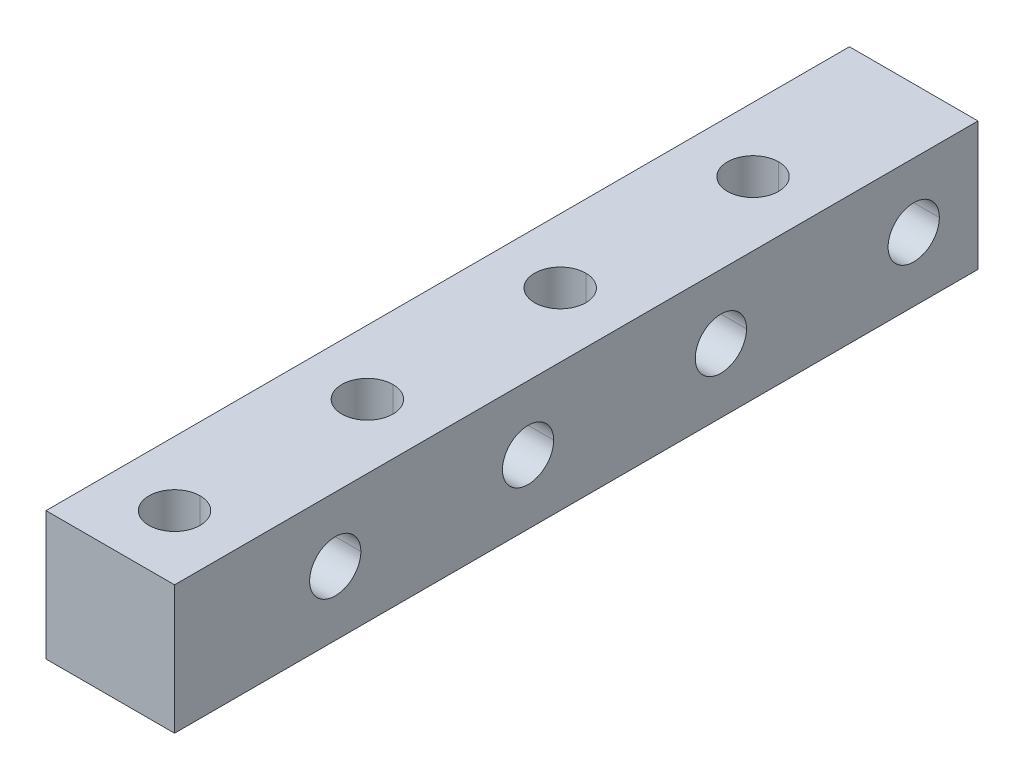
ISO-10303-21;
HEADER;
FILE_DESCRIPTION(('STEP AP214'),'2;1');
FILE_NAME('part.step','',(''),(''),'','','');
FILE_SCHEMA(('AUTOMOTIVE_DESIGN { 1 0 10303 214 1 1 1 1 }'));
ENDSEC;
DATA;
#1=APPLICATION_CONTEXT('core data for automotive mechanical design processes');
#2=APPLICATION_PROTOCOL_DEFINITION('international standard','automotive_design',2000,#1);
#3=PRODUCT_CONTEXT('',#1,'mechanical');
#4=PRODUCT('Part','Part','',(#3));
#5=PRODUCT_RELATED_PRODUCT_CATEGORY('part','',(#4));
#6=PRODUCT_DEFINITION_FORMATION('','',#4);
#7=PRODUCT_DEFINITION_CONTEXT('part definition',#1,'design');
#8=PRODUCT_DEFINITION('design','',#6,#7);
#9=PRODUCT_DEFINITION_SHAPE('','',#8);
#10=(LENGTH_UNIT() NAMED_UNIT(*) SI_UNIT(.MILLI.,.METRE.));
#11=(NAMED_UNIT(*) PLANE_ANGLE_UNIT() SI_UNIT($,.RADIAN.));
#12=(NAMED_UNIT(*) SI_UNIT($,.STERADIAN.) SOLID_ANGLE_UNIT());
#13=UNCERTAINTY_MEASURE_WITH_UNIT(LENGTH_MEASURE(1.E-05),#10,'distance_accuracy_value','');
#14=(GEOMETRIC_REPRESENTATION_CONTEXT(3) GLOBAL_UNCERTAINTY_ASSIGNED_CONTEXT((#13)) GLOBAL_UNIT_ASSIGNED_CONTEXT((#10,
#11,#12)) REPRESENTATION_CONTEXT('',''));
#15=CARTESIAN_POINT('',(0.,0.,0.));
#16=DIRECTION('',(0.,0.,1.));
#17=DIRECTION('',(1.,0.,0.));
#18=AXIS2_PLACEMENT_3D('',#15,#16,#17);
#19=CARTESIAN_POINT('',(-4.7625,4.7625,-59.53125));
#20=DIRECTION('',(0.,0.,1.));
#21=DIRECTION('',(1.,0.,0.));
#22=AXIS2_PLACEMENT_3D('',#19,#20,#21);
#23=PLANE('',#22);
#24=DIRECTION('',(0.,-1.,0.));
#25=VECTOR('',#24,1.);
#26=CARTESIAN_POINT('',(4.7625,4.7625,-59.53125));
#27=LINE('',#26,#25);
#28=CARTESIAN_POINT('',(4.7625,4.7625,-59.53125));
#29=VERTEX_POINT('',#28);
#30=CARTESIAN_POINT('',(4.7625,-4.7625,-59.53125));
#31=VERTEX_POINT('',#30);
#32=EDGE_CURVE('E279',#29,#31,#27,.T.);
#33=ORIENTED_EDGE('',*,*,#32,.T.);
#34=DIRECTION('',(1.,0.,0.));
#35=VECTOR('',#34,1.);
#36=CARTESIAN_POINT('',(-4.7625,-4.7625,-59.53125));
#37=LINE('',#36,#35);
#38=CARTESIAN_POINT('',(-4.7625,-4.7625,-59.53125));
#39=VERTEX_POINT('',#38);
#40=EDGE_CURVE('E258',#39,#31,#37,.T.);
#41=ORIENTED_EDGE('',*,*,#40,.F.);
#42=DIRECTION('',(0.,-1.,0.));
#43=VECTOR('',#42,1.);
#44=CARTESIAN_POINT('',(-4.7625,4.7625,-59.53125));
#45=LINE('',#44,#43);
#46=CARTESIAN_POINT('',(-4.7625,4.7625,-59.53125));
#47=VERTEX_POINT('',#46);
#48=EDGE_CURVE('E249',#47,#39,#45,.T.);
#49=ORIENTED_EDGE('',*,*,#48,.F.);
#50=DIRECTION('',(1.,0.,0.));
#51=VECTOR('',#50,1.);
#52=CARTESIAN_POINT('',(-4.7625,4.7625,-59.53125));
#53=LINE('',#52,#51);
#54=EDGE_CURVE('E232',#47,#29,#53,.T.);
#55=ORIENTED_EDGE('',*,*,#54,.T.);
#56=EDGE_LOOP('',(#33,#41,#49,#55));
#57=FACE_BOUND('',#56,.T.);
#58=ADVANCED_FACE('F16',(#57),#23,.F.);
#59=CARTESIAN_POINT('',(4.7625,0.,-54.76875));
#60=DIRECTION('',(1.,0.,0.));
#61=DIRECTION('',(0.,0.,-1.));
#62=AXIS2_PLACEMENT_3D('',#59,#60,#61);
#63=CYLINDRICAL_SURFACE('',#62,1.89865);
#64=DIRECTION('',(1.,0.,0.));
#65=VECTOR('',#64,1.);
#66=CARTESIAN_POINT('',(4.7625,0.,-52.8701));
#67=LINE('',#66,#65);
#68=CARTESIAN_POINT('',(-4.7625,0.,-52.8701));
#69=VERTEX_POINT('',#68);
#70=CARTESIAN_POINT('',(4.7625,0.,-52.8701));
#71=VERTEX_POINT('',#70);
#72=EDGE_CURVE('E324',#69,#71,#67,.T.);
#73=ORIENTED_EDGE('',*,*,#72,.F.);
#74=CARTESIAN_POINT('',(-4.7625,0.,-54.76875));
#75=DIRECTION('',(1.,0.,0.));
#76=DIRECTION('',(0.,0.,-1.));
#77=AXIS2_PLACEMENT_3D('',#74,#75,#76);
#78=CIRCLE('',#77,1.89865);
#79=CARTESIAN_POINT('',(-4.7625,0.,-56.6674));
#80=VERTEX_POINT('',#79);
#81=EDGE_CURVE('E406',#80,#69,#78,.T.);
#82=ORIENTED_EDGE('',*,*,#81,.F.);
#83=DIRECTION('',(1.,0.,0.));
#84=VECTOR('',#83,1.);
#85=CARTESIAN_POINT('',(4.7625,0.,-56.6674));
#86=LINE('',#85,#84);
#87=CARTESIAN_POINT('',(4.7625,0.,-56.6674));
#88=VERTEX_POINT('',#87);
#89=EDGE_CURVE('E251',#80,#88,#86,.T.);
#90=ORIENTED_EDGE('',*,*,#89,.T.);
#91=CARTESIAN_POINT('',(4.7625,0.,-54.76875));
#92=DIRECTION('',(1.,0.,0.));
#93=DIRECTION('',(0.,0.,-1.));
#94=AXIS2_PLACEMENT_3D('',#91,#92,#93);
#95=CIRCLE('',#94,1.89865);
#96=EDGE_CURVE('E268',#88,#71,#95,.T.);
#97=ORIENTED_EDGE('',*,*,#96,.T.);
#98=EDGE_LOOP('',(#73,#82,#90,#97));
#99=FACE_BOUND('',#98,.T.);
#100=ADVANCED_FACE('F473',(#99),#63,.F.);
#101=CARTESIAN_POINT('',(4.7625,0.,-40.48125));
#102=DIRECTION('',(1.,0.,0.));
#103=DIRECTION('',(0.,0.,-1.));
#104=AXIS2_PLACEMENT_3D('',#101,#102,#103);
#105=CYLINDRICAL_SURFACE('',#104,1.89865);
#106=DIRECTION('',(1.,0.,0.));
#107=VECTOR('',#106,1.);
#108=CARTESIAN_POINT('',(4.7625,0.,-38.5826));
#109=LINE('',#108,#107);
#110=CARTESIAN_POINT('',(-4.7625,0.,-38.5826));
#111=VERTEX_POINT('',#110);
#112=CARTESIAN_POINT('',(4.7625,0.,-38.5826));
#113=VERTEX_POINT('',#112);
#114=EDGE_CURVE('E234',#111,#113,#109,.T.);
#115=ORIENTED_EDGE('',*,*,#114,.F.);
#116=CARTESIAN_POINT('',(-4.7625,0.,-40.48125));
#117=DIRECTION('',(1.,0.,0.));
#118=DIRECTION('',(0.,0.,-1.));
#119=AXIS2_PLACEMENT_3D('',#116,#117,#118);
#120=CIRCLE('',#119,1.89865);
#121=CARTESIAN_POINT('',(-4.7625,0.,-42.3799));
#122=VERTEX_POINT('',#121);
#123=EDGE_CURVE('E178',#122,#111,#120,.T.);
#124=ORIENTED_EDGE('',*,*,#123,.F.);
#125=DIRECTION('',(1.,0.,0.));
#126=VECTOR('',#125,1.);
#127=CARTESIAN_POINT('',(4.7625,0.,-42.3799));
#128=LINE('',#127,#126);
#129=CARTESIAN_POINT('',(4.7625,0.,-42.3799));
#130=VERTEX_POINT('',#129);
#131=EDGE_CURVE('E311',#122,#130,#128,.T.);
#132=ORIENTED_EDGE('',*,*,#131,.T.);
#133=CARTESIAN_POINT('',(4.7625,0.,-40.48125));
#134=DIRECTION('',(1.,0.,0.));
#135=DIRECTION('',(0.,0.,-1.));
#136=AXIS2_PLACEMENT_3D('',#133,#134,#135);
#137=CIRCLE('',#136,1.89865);
#138=EDGE_CURVE('E169',#130,#113,#137,.T.);
#139=ORIENTED_EDGE('',*,*,#138,.T.);
#140=EDGE_LOOP('',(#115,#124,#132,#139));
#141=FACE_BOUND('',#140,.T.);
#142=ADVANCED_FACE('F478',(#141),#105,.F.);
#143=CARTESIAN_POINT('',(4.7625,0.,-26.19375));
#144=DIRECTION('',(1.,0.,0.));
#145=DIRECTION('',(0.,0.,-1.));
#146=AXIS2_PLACEMENT_3D('',#143,#144,#145);
#147=CYLINDRICAL_SURFACE('',#146,1.89865);
#148=DIRECTION('',(1.,0.,0.));
#149=VECTOR('',#148,1.);
#150=CARTESIAN_POINT('',(4.7625,0.,-24.2951));
#151=LINE('',#150,#149);
#152=CARTESIAN_POINT('',(-4.7625,0.,-24.2951));
#153=VERTEX_POINT('',#152);
#154=CARTESIAN_POINT('',(4.7625,0.,-24.2951));
#155=VERTEX_POINT('',#154);
#156=EDGE_CURVE('E228',#153,#155,#151,.T.);
#157=ORIENTED_EDGE('',*,*,#156,.F.);
#158=CARTESIAN_POINT('',(-4.7625,0.,-26.19375));
#159=DIRECTION('',(1.,0.,0.));
#160=DIRECTION('',(0.,0.,-1.));
#161=AXIS2_PLACEMENT_3D('',#158,#159,#160);
#162=CIRCLE('',#161,1.89865);
#163=CARTESIAN_POINT('',(-4.7625,0.,-28.0924));
#164=VERTEX_POINT('',#163);
#165=EDGE_CURVE('E233',#164,#153,#162,.T.);
#166=ORIENTED_EDGE('',*,*,#165,.F.);
#167=DIRECTION('',(1.,0.,0.));
#168=VECTOR('',#167,1.);
#169=CARTESIAN_POINT('',(4.7625,0.,-28.0924));
#170=LINE('',#169,#168);
#171=CARTESIAN_POINT('',(4.7625,0.,-28.0924));
#172=VERTEX_POINT('',#171);
#173=EDGE_CURVE('E340',#164,#172,#170,.T.);
#174=ORIENTED_EDGE('',*,*,#173,.T.);
#175=CARTESIAN_POINT('',(4.7625,0.,-26.19375));
#176=DIRECTION('',(1.,0.,0.));
#177=DIRECTION('',(0.,0.,-1.));
#178=AXIS2_PLACEMENT_3D('',#175,#176,#177);
#179=CIRCLE('',#178,1.89865);
#180=EDGE_CURVE('E267',#172,#155,#179,.T.);
#181=ORIENTED_EDGE('',*,*,#180,.T.);
#182=EDGE_LOOP('',(#157,#166,#174,#181));
#183=FACE_BOUND('',#182,.T.);
#184=ADVANCED_FACE('F509',(#183),#147,.F.);
#185=CARTESIAN_POINT('',(0.,4.7625,-47.625));
#186=DIRECTION('',(0.,1.,0.));
#187=DIRECTION('',(0.,0.,1.));
#188=AXIS2_PLACEMENT_3D('',#185,#186,#187);
#189=CYLINDRICAL_SURFACE('',#188,1.89865);
#190=DIRECTION('',(0.,1.,0.));
#191=VECTOR('',#190,1.);
#192=CARTESIAN_POINT('',(0.,4.7625,-49.52365));
#193=LINE('',#192,#191);
#194=CARTESIAN_POINT('',(0.,-4.7625,-49.52365));
#195=VERTEX_POINT('',#194);
#196=CARTESIAN_POINT('',(0.,4.7625,-49.52365));
#197=VERTEX_POINT('',#196);
#198=EDGE_CURVE('E240',#195,#197,#193,.T.);
#199=ORIENTED_EDGE('',*,*,#198,.F.);
#200=CARTESIAN_POINT('',(0.,-4.7625,-47.625));
#201=DIRECTION('',(0.,1.,0.));
#202=DIRECTION('',(0.,0.,1.));
#203=AXIS2_PLACEMENT_3D('',#200,#201,#202);
#204=CIRCLE('',#203,1.89865);
#205=CARTESIAN_POINT('',(0.,-4.7625,-45.72635));
#206=VERTEX_POINT('',#205);
#207=EDGE_CURVE('E202',#206,#195,#204,.T.);
#208=ORIENTED_EDGE('',*,*,#207,.F.);
#209=DIRECTION('',(0.,1.,0.));
#210=VECTOR('',#209,1.);
#211=CARTESIAN_POINT('',(0.,4.7625,-45.72635));
#212=LINE('',#211,#210);
#213=CARTESIAN_POINT('',(0.,4.7625,-45.72635));
#214=VERTEX_POINT('',#213);
#215=EDGE_CURVE('E217',#206,#214,#212,.T.);
#216=ORIENTED_EDGE('',*,*,#215,.T.);
#217=CARTESIAN_POINT('',(0.,4.7625,-47.625));
#218=DIRECTION('',(0.,1.,0.));
#219=DIRECTION('',(0.,0.,1.));
#220=AXIS2_PLACEMENT_3D('',#217,#218,#219);
#221=CIRCLE('',#220,1.89865);
#222=EDGE_CURVE('E292',#214,#197,#221,.T.);
#223=ORIENTED_EDGE('',*,*,#222,.T.);
#224=EDGE_LOOP('',(#199,#208,#216,#223));
#225=FACE_BOUND('',#224,.T.);
#226=ADVANCED_FACE('F541',(#225),#189,.F.);
#227=CARTESIAN_POINT('',(0.,4.7625,-33.3375));
#228=DIRECTION('',(0.,1.,0.));
#229=DIRECTION('',(0.,0.,1.));
#230=AXIS2_PLACEMENT_3D('',#227,#228,#229);
#231=CYLINDRICAL_SURFACE('',#230,1.89865);
#232=DIRECTION('',(0.,1.,0.));
#233=VECTOR('',#232,1.);
#234=CARTESIAN_POINT('',(0.,4.7625,-35.23615));
#235=LINE('',#234,#233);
#236=CARTESIAN_POINT('',(0.,-4.7625,-35.23615));
#237=VERTEX_POINT('',#236);
#238=CARTESIAN_POINT('',(0.,4.7625,-35.23615));
#239=VERTEX_POINT('',#238);
#240=EDGE_CURVE('E205',#237,#239,#235,.T.);
#241=ORIENTED_EDGE('',*,*,#240,.F.);
#242=CARTESIAN_POINT('',(0.,-4.7625,-33.3375));
#243=DIRECTION('',(0.,1.,0.));
#244=DIRECTION('',(0.,0.,1.));
#245=AXIS2_PLACEMENT_3D('',#242,#243,#244);
#246=CIRCLE('',#245,1.89865);
#247=CARTESIAN_POINT('',(0.,-4.7625,-31.43885));
#248=VERTEX_POINT('',#247);
#249=EDGE_CURVE('E192',#248,#237,#246,.T.);
#250=ORIENTED_EDGE('',*,*,#249,.F.);
#251=DIRECTION('',(0.,1.,0.));
#252=VECTOR('',#251,1.);
#253=CARTESIAN_POINT('',(0.,4.7625,-31.43885));
#254=LINE('',#253,#252);
#255=CARTESIAN_POINT('',(0.,4.7625,-31.43885));
#256=VERTEX_POINT('',#255);
#257=EDGE_CURVE('E215',#248,#256,#254,.T.);
#258=ORIENTED_EDGE('',*,*,#257,.T.);
#259=CARTESIAN_POINT('',(0.,4.7625,-33.3375));
#260=DIRECTION('',(0.,1.,0.));
#261=DIRECTION('',(0.,0.,1.));
#262=AXIS2_PLACEMENT_3D('',#259,#260,#261);
#263=CIRCLE('',#262,1.89865);
#264=EDGE_CURVE('E207',#256,#239,#263,.T.);
#265=ORIENTED_EDGE('',*,*,#264,.T.);
#266=EDGE_LOOP('',(#241,#250,#258,#265));
#267=FACE_BOUND('',#266,.T.);
#268=ADVANCED_FACE('F206',(#267),#231,.F.);
#269=CARTESIAN_POINT('',(0.,4.7625,-19.05));
#270=DIRECTION('',(0.,1.,0.));
#271=DIRECTION('',(0.,0.,1.));
#272=AXIS2_PLACEMENT_3D('',#269,#270,#271);
#273=CYLINDRICAL_SURFACE('',#272,1.89865);
#274=DIRECTION('',(0.,1.,0.));
#275=VECTOR('',#274,1.);
#276=CARTESIAN_POINT('',(0.,4.7625,-20.94865));
#277=LINE('',#276,#275);
#278=CARTESIAN_POINT('',(0.,-4.7625,-20.94865));
#279=VERTEX_POINT('',#278);
#280=CARTESIAN_POINT('',(0.,4.7625,-20.94865));
#281=VERTEX_POINT('',#280);
#282=EDGE_CURVE('E20',#279,#281,#277,.T.);
#283=ORIENTED_EDGE('',*,*,#282,.F.);
#284=CARTESIAN_POINT('',(0.,-4.7625,-19.05));
#285=DIRECTION('',(0.,1.,0.));
#286=DIRECTION('',(0.,0.,1.));
#287=AXIS2_PLACEMENT_3D('',#284,#285,#286);
#288=CIRCLE('',#287,1.89865);
#289=CARTESIAN_POINT('',(0.,-4.7625,-17.15135));
#290=VERTEX_POINT('',#289);
#291=EDGE_CURVE('E27',#290,#279,#288,.T.);
#292=ORIENTED_EDGE('',*,*,#291,.F.);
#293=DIRECTION('',(0.,1.,0.));
#294=VECTOR('',#293,1.);
#295=CARTESIAN_POINT('',(0.,4.7625,-17.15135));
#296=LINE('',#295,#294);
#297=CARTESIAN_POINT('',(0.,4.7625,-17.15135));
#298=VERTEX_POINT('',#297);
#299=EDGE_CURVE('E274',#290,#298,#296,.T.);
#300=ORIENTED_EDGE('',*,*,#299,.T.);
#301=CARTESIAN_POINT('',(0.,4.7625,-19.05));
#302=DIRECTION('',(0.,1.,0.));
#303=DIRECTION('',(0.,0.,1.));
#304=AXIS2_PLACEMENT_3D('',#301,#302,#303);
#305=CIRCLE('',#304,1.89865);
#306=EDGE_CURVE('E291',#298,#281,#305,.T.);
#307=ORIENTED_EDGE('',*,*,#306,.T.);
#308=EDGE_LOOP('',(#283,#292,#300,#307));
#309=FACE_BOUND('',#308,.T.);
#310=ADVANCED_FACE('F378',(#309),#273,.F.);
#311=CARTESIAN_POINT('',(4.7625,0.,-11.90625));
#312=DIRECTION('',(1.,0.,0.));
#313=DIRECTION('',(0.,0.,-1.));
#314=AXIS2_PLACEMENT_3D('',#311,#312,#313);
#315=CYLINDRICAL_SURFACE('',#314,1.89865);
#316=DIRECTION('',(1.,0.,0.));
#317=VECTOR('',#316,1.);
#318=CARTESIAN_POINT('',(4.7625,0.,-10.0076));
#319=LINE('',#318,#317);
#320=CARTESIAN_POINT('',(-4.7625,0.,-10.0076));
#321=VERTEX_POINT('',#320);
#322=CARTESIAN_POINT('',(4.7625,0.,-10.0076));
#323=VERTEX_POINT('',#322);
#324=EDGE_CURVE('E273',#321,#323,#319,.T.);
#325=ORIENTED_EDGE('',*,*,#324,.F.);
#326=CARTESIAN_POINT('',(-4.7625,0.,-11.90625));
#327=DIRECTION('',(1.,0.,0.));
#328=DIRECTION('',(0.,0.,-1.));
#329=AXIS2_PLACEMENT_3D('',#326,#327,#328);
#330=CIRCLE('',#329,1.89865);
#331=CARTESIAN_POINT('',(-4.7625,0.,-13.8049));
#332=VERTEX_POINT('',#331);
#333=EDGE_CURVE('E229',#332,#321,#330,.T.);
#334=ORIENTED_EDGE('',*,*,#333,.F.);
#335=DIRECTION('',(1.,0.,0.));
#336=VECTOR('',#335,1.);
#337=CARTESIAN_POINT('',(4.7625,0.,-13.8049));
#338=LINE('',#337,#336);
#339=CARTESIAN_POINT('',(4.7625,0.,-13.8049));
#340=VERTEX_POINT('',#339);
#341=EDGE_CURVE('E264',#332,#340,#338,.T.);
#342=ORIENTED_EDGE('',*,*,#341,.T.);
#343=CARTESIAN_POINT('',(4.7625,0.,-11.90625));
#344=DIRECTION('',(1.,0.,0.));
#345=DIRECTION('',(0.,0.,-1.));
#346=AXIS2_PLACEMENT_3D('',#343,#344,#345);
#347=CIRCLE('',#346,1.89865);
#348=EDGE_CURVE('E332',#340,#323,#347,.T.);
#349=ORIENTED_EDGE('',*,*,#348,.T.);
#350=EDGE_LOOP('',(#325,#334,#342,#349));
#351=FACE_BOUND('',#350,.T.);
#352=ADVANCED_FACE('F489',(#351),#315,.F.);
#353=CARTESIAN_POINT('',(0.,4.7625,-4.7625));
#354=DIRECTION('',(0.,1.,0.));
#355=DIRECTION('',(0.,0.,1.));
#356=AXIS2_PLACEMENT_3D('',#353,#354,#355);
#357=CYLINDRICAL_SURFACE('',#356,1.89865);
#358=DIRECTION('',(0.,1.,0.));
#359=VECTOR('',#358,1.);
#360=CARTESIAN_POINT('',(0.,4.7625,-6.66115));
#361=LINE('',#360,#359);
#362=CARTESIAN_POINT('',(0.,-4.7625,-6.66115));
#363=VERTEX_POINT('',#362);
#364=CARTESIAN_POINT('',(0.,4.7625,-6.66115));
#365=VERTEX_POINT('',#364);
#366=EDGE_CURVE('E263',#363,#365,#361,.T.);
#367=ORIENTED_EDGE('',*,*,#366,.F.);
#368=CARTESIAN_POINT('',(0.,-4.7625,-4.7625));
#369=DIRECTION('',(0.,1.,0.));
#370=DIRECTION('',(0.,0.,1.));
#371=AXIS2_PLACEMENT_3D('',#368,#369,#370);
#372=CIRCLE('',#371,1.89865);
#373=CARTESIAN_POINT('',(0.,-4.7625,-2.86385));
#374=VERTEX_POINT('',#373);
#375=EDGE_CURVE('E11',#374,#363,#372,.T.);
#376=ORIENTED_EDGE('',*,*,#375,.F.);
#377=DIRECTION('',(0.,1.,0.));
#378=VECTOR('',#377,1.);
#379=CARTESIAN_POINT('',(0.,4.7625,-2.86385));
#380=LINE('',#379,#378);
#381=CARTESIAN_POINT('',(0.,4.7625,-2.86385));
#382=VERTEX_POINT('',#381);
#383=EDGE_CURVE('E245',#374,#382,#380,.T.);
#384=ORIENTED_EDGE('',*,*,#383,.T.);
#385=CARTESIAN_POINT('',(0.,4.7625,-4.7625));
#386=DIRECTION('',(0.,1.,0.));
#387=DIRECTION('',(0.,0.,1.));
#388=AXIS2_PLACEMENT_3D('',#385,#386,#387);
#389=CIRCLE('',#388,1.89865);
#390=EDGE_CURVE('E284',#382,#365,#389,.T.);
#391=ORIENTED_EDGE('',*,*,#390,.T.);
#392=EDGE_LOOP('',(#367,#376,#384,#391));
#393=FACE_BOUND('',#392,.T.);
#394=ADVANCED_FACE('F482',(#393),#357,.F.);
#395=CARTESIAN_POINT('',(-4.7625,4.7625,0.));
#396=DIRECTION('',(0.,0.,1.));
#397=DIRECTION('',(1.,0.,0.));
#398=AXIS2_PLACEMENT_3D('',#395,#396,#397);
#399=PLANE('',#398);
#400=DIRECTION('',(0.,-1.,0.));
#401=VECTOR('',#400,1.);
#402=CARTESIAN_POINT('',(-4.7625,-4.7625,0.));
#403=LINE('',#402,#401);
#404=CARTESIAN_POINT('',(-4.7625,4.7625,0.));
#405=VERTEX_POINT('',#404);
#406=CARTESIAN_POINT('',(-4.7625,-4.7625,0.));
#407=VERTEX_POINT('',#406);
#408=EDGE_CURVE('E404',#405,#407,#403,.T.);
#409=ORIENTED_EDGE('',*,*,#408,.T.);
#410=DIRECTION('',(1.,0.,0.));
#411=VECTOR('',#410,1.);
#412=CARTESIAN_POINT('',(4.7625,-4.7625,0.));
#413=LINE('',#412,#411);
#414=CARTESIAN_POINT('',(4.7625,-4.7625,0.));
#415=VERTEX_POINT('',#414);
#416=EDGE_CURVE('E42',#407,#415,#413,.T.);
#417=ORIENTED_EDGE('',*,*,#416,.T.);
#418=DIRECTION('',(0.,1.,0.));
#419=VECTOR('',#418,1.);
#420=CARTESIAN_POINT('',(4.7625,-4.7625,0.));
#421=LINE('',#420,#419);
#422=CARTESIAN_POINT('',(4.7625,4.7625,0.));
#423=VERTEX_POINT('',#422);
#424=EDGE_CURVE('E283',#415,#423,#421,.T.);
#425=ORIENTED_EDGE('',*,*,#424,.T.);
#426=DIRECTION('',(-1.,0.,0.));
#427=VECTOR('',#426,1.);
#428=CARTESIAN_POINT('',(4.7625,4.7625,0.));
#429=LINE('',#428,#427);
#430=EDGE_CURVE('E354',#423,#405,#429,.T.);
#431=ORIENTED_EDGE('',*,*,#430,.T.);
#432=EDGE_LOOP('',(#409,#417,#425,#431));
#433=FACE_BOUND('',#432,.T.);
#434=ADVANCED_FACE('F455',(#433),#399,.T.);
#435=CARTESIAN_POINT('',(4.7625,-4.7625,-65.65646));
#436=DIRECTION('',(0.,-1.,0.));
#437=DIRECTION('',(0.,0.,-1.));
#438=AXIS2_PLACEMENT_3D('',#435,#436,#437);
#439=PLANE('',#438);
#440=ORIENTED_EDGE('',*,*,#375,.T.);
#441=CARTESIAN_POINT('',(0.,-4.7625,-4.7625));
#442=DIRECTION('',(0.,1.,0.));
#443=DIRECTION('',(0.,0.,1.));
#444=AXIS2_PLACEMENT_3D('',#441,#442,#443);
#445=CIRCLE('',#444,1.89865);
#446=EDGE_CURVE('E259',#363,#374,#445,.T.);
#447=ORIENTED_EDGE('',*,*,#446,.T.);
#448=EDGE_LOOP('',(#440,#447));
#449=FACE_BOUND('',#448,.T.);
#450=ORIENTED_EDGE('',*,*,#291,.T.);
#451=CARTESIAN_POINT('',(0.,-4.7625,-19.05));
#452=DIRECTION('',(0.,1.,0.));
#453=DIRECTION('',(0.,0.,1.));
#454=AXIS2_PLACEMENT_3D('',#451,#452,#453);
#455=CIRCLE('',#454,1.89865);
#456=EDGE_CURVE('E314',#279,#290,#455,.T.);
#457=ORIENTED_EDGE('',*,*,#456,.T.);
#458=EDGE_LOOP('',(#450,#457));
#459=FACE_BOUND('',#458,.T.);
#460=ORIENTED_EDGE('',*,*,#249,.T.);
#461=CARTESIAN_POINT('',(0.,-4.7625,-33.3375));
#462=DIRECTION('',(0.,1.,0.));
#463=DIRECTION('',(0.,0.,1.));
#464=AXIS2_PLACEMENT_3D('',#461,#462,#463);
#465=CIRCLE('',#464,1.89865);
#466=EDGE_CURVE('E197',#237,#248,#465,.T.);
#467=ORIENTED_EDGE('',*,*,#466,.T.);
#468=EDGE_LOOP('',(#460,#467));
#469=FACE_BOUND('',#468,.T.);
#470=ORIENTED_EDGE('',*,*,#207,.T.);
#471=CARTESIAN_POINT('',(0.,-4.7625,-47.625));
#472=DIRECTION('',(0.,1.,0.));
#473=DIRECTION('',(0.,0.,1.));
#474=AXIS2_PLACEMENT_3D('',#471,#472,#473);
#475=CIRCLE('',#474,1.89865);
#476=EDGE_CURVE('E243',#195,#206,#475,.T.);
#477=ORIENTED_EDGE('',*,*,#476,.T.);
#478=EDGE_LOOP('',(#470,#477));
#479=FACE_BOUND('',#478,.T.);
#480=ORIENTED_EDGE('',*,*,#40,.T.);
#481=DIRECTION('',(0.,0.,1.));
#482=VECTOR('',#481,1.);
#483=CARTESIAN_POINT('',(4.7625,-4.7625,-65.65646));
#484=LINE('',#483,#482);
#485=EDGE_CURVE('E296',#31,#415,#484,.T.);
#486=ORIENTED_EDGE('',*,*,#485,.T.);
#487=ORIENTED_EDGE('',*,*,#416,.F.);
#488=DIRECTION('',(0.,0.,1.));
#489=VECTOR('',#488,1.);
#490=CARTESIAN_POINT('',(-4.7625,-4.7625,-65.65646));
#491=LINE('',#490,#489);
#492=EDGE_CURVE('E410',#39,#407,#491,.T.);
#493=ORIENTED_EDGE('',*,*,#492,.F.);
#494=EDGE_LOOP('',(#480,#486,#487,#493));
#495=FACE_BOUND('',#494,.T.);
#496=ADVANCED_FACE('F194',(#449,#459,#469,#479,#495),#439,.T.);
#497=CARTESIAN_POINT('',(4.7625,-4.7625,-65.65646));
#498=DIRECTION('',(1.,0.,0.));
#499=DIRECTION('',(0.,1.,0.));
#500=AXIS2_PLACEMENT_3D('',#497,#498,#499);
#501=PLANE('',#500);
#502=ORIENTED_EDGE('',*,*,#348,.F.);
#503=CARTESIAN_POINT('',(4.7625,0.,-11.90625));
#504=DIRECTION('',(1.,0.,0.));
#505=DIRECTION('',(0.,0.,-1.));
#506=AXIS2_PLACEMENT_3D('',#503,#504,#505);
#507=CIRCLE('',#506,1.89865);
#508=EDGE_CURVE('E288',#323,#340,#507,.T.);
#509=ORIENTED_EDGE('',*,*,#508,.F.);
#510=EDGE_LOOP('',(#502,#509));
#511=FACE_BOUND('',#510,.T.);
#512=ORIENTED_EDGE('',*,*,#180,.F.);
#513=CARTESIAN_POINT('',(4.7625,0.,-26.19375));
#514=DIRECTION('',(1.,0.,0.));
#515=DIRECTION('',(0.,0.,-1.));
#516=AXIS2_PLACEMENT_3D('',#513,#514,#515);
#517=CIRCLE('',#516,1.89865);
#518=EDGE_CURVE('E344',#155,#172,#517,.T.);
#519=ORIENTED_EDGE('',*,*,#518,.F.);
#520=EDGE_LOOP('',(#512,#519));
#521=FACE_BOUND('',#520,.T.);
#522=ORIENTED_EDGE('',*,*,#138,.F.);
#523=CARTESIAN_POINT('',(4.7625,0.,-40.48125));
#524=DIRECTION('',(1.,0.,0.));
#525=DIRECTION('',(0.,0.,-1.));
#526=AXIS2_PLACEMENT_3D('',#523,#524,#525);
#527=CIRCLE('',#526,1.89865);
#528=EDGE_CURVE('E238',#113,#130,#527,.T.);
#529=ORIENTED_EDGE('',*,*,#528,.F.);
#530=EDGE_LOOP('',(#522,#529));
#531=FACE_BOUND('',#530,.T.);
#532=ORIENTED_EDGE('',*,*,#96,.F.);
#533=CARTESIAN_POINT('',(4.7625,0.,-54.76875));
#534=DIRECTION('',(1.,0.,0.));
#535=DIRECTION('',(0.,0.,-1.));
#536=AXIS2_PLACEMENT_3D('',#533,#534,#535);
#537=CIRCLE('',#536,1.89865);
#538=EDGE_CURVE('E255',#71,#88,#537,.T.);
#539=ORIENTED_EDGE('',*,*,#538,.F.);
#540=EDGE_LOOP('',(#532,#539));
#541=FACE_BOUND('',#540,.T.);
#542=ORIENTED_EDGE('',*,*,#32,.F.);
#543=DIRECTION('',(0.,0.,1.));
#544=VECTOR('',#543,1.);
#545=CARTESIAN_POINT('',(4.7625,4.7625,-65.65646));
#546=LINE('',#545,#544);
#547=EDGE_CURVE('E347',#29,#423,#546,.T.);
#548=ORIENTED_EDGE('',*,*,#547,.T.);
#549=ORIENTED_EDGE('',*,*,#424,.F.);
#550=ORIENTED_EDGE('',*,*,#485,.F.);
#551=EDGE_LOOP('',(#542,#548,#549,#550));
#552=FACE_BOUND('',#551,.T.);
#553=ADVANCED_FACE('F386',(#511,#521,#531,#541,#552),#501,.T.);
#554=CARTESIAN_POINT('',(4.7625,4.7625,-65.65646));
#555=DIRECTION('',(0.,1.,0.));
#556=DIRECTION('',(1.,0.,0.));
#557=AXIS2_PLACEMENT_3D('',#554,#555,#556);
#558=PLANE('',#557);
#559=ORIENTED_EDGE('',*,*,#390,.F.);
#560=CARTESIAN_POINT('',(0.,4.7625,-4.7625));
#561=DIRECTION('',(0.,1.,0.));
#562=DIRECTION('',(0.,0.,1.));
#563=AXIS2_PLACEMENT_3D('',#560,#561,#562);
#564=CIRCLE('',#563,1.89865);
#565=EDGE_CURVE('E250',#365,#382,#564,.T.);
#566=ORIENTED_EDGE('',*,*,#565,.F.);
#567=EDGE_LOOP('',(#559,#566));
#568=FACE_BOUND('',#567,.T.);
#569=ORIENTED_EDGE('',*,*,#306,.F.);
#570=CARTESIAN_POINT('',(0.,4.7625,-19.05));
#571=DIRECTION('',(0.,1.,0.));
#572=DIRECTION('',(0.,0.,1.));
#573=AXIS2_PLACEMENT_3D('',#570,#571,#572);
#574=CIRCLE('',#573,1.89865);
#575=EDGE_CURVE('E275',#281,#298,#574,.T.);
#576=ORIENTED_EDGE('',*,*,#575,.F.);
#577=EDGE_LOOP('',(#569,#576));
#578=FACE_BOUND('',#577,.T.);
#579=ORIENTED_EDGE('',*,*,#264,.F.);
#580=CARTESIAN_POINT('',(0.,4.7625,-33.3375));
#581=DIRECTION('',(0.,1.,0.));
#582=DIRECTION('',(0.,0.,1.));
#583=AXIS2_PLACEMENT_3D('',#580,#581,#582);
#584=CIRCLE('',#583,1.89865);
#585=EDGE_CURVE('E212',#239,#256,#584,.T.);
#586=ORIENTED_EDGE('',*,*,#585,.F.);
#587=EDGE_LOOP('',(#579,#586));
#588=FACE_BOUND('',#587,.T.);
#589=ORIENTED_EDGE('',*,*,#222,.F.);
#590=CARTESIAN_POINT('',(0.,4.7625,-47.625));
#591=DIRECTION('',(0.,1.,0.));
#592=DIRECTION('',(0.,0.,1.));
#593=AXIS2_PLACEMENT_3D('',#590,#591,#592);
#594=CIRCLE('',#593,1.89865);
#595=EDGE_CURVE('E224',#197,#214,#594,.T.);
#596=ORIENTED_EDGE('',*,*,#595,.F.);
#597=EDGE_LOOP('',(#589,#596));
#598=FACE_BOUND('',#597,.T.);
#599=ORIENTED_EDGE('',*,*,#54,.F.);
#600=DIRECTION('',(0.,0.,1.));
#601=VECTOR('',#600,1.);
#602=CARTESIAN_POINT('',(-4.7625,4.7625,-65.65646));
#603=LINE('',#602,#601);
#604=EDGE_CURVE('E396',#47,#405,#603,.T.);
#605=ORIENTED_EDGE('',*,*,#604,.T.);
#606=ORIENTED_EDGE('',*,*,#430,.F.);
#607=ORIENTED_EDGE('',*,*,#547,.F.);
#608=EDGE_LOOP('',(#599,#605,#606,#607));
#609=FACE_BOUND('',#608,.T.);
#610=ADVANCED_FACE('F382',(#568,#578,#588,#598,#609),#558,.T.);
#611=CARTESIAN_POINT('',(-4.7625,-4.7625,-65.65646));
#612=DIRECTION('',(-1.,0.,0.));
#613=DIRECTION('',(0.,0.,1.));
#614=AXIS2_PLACEMENT_3D('',#611,#612,#613);
#615=PLANE('',#614);
#616=ORIENTED_EDGE('',*,*,#333,.T.);
#617=CARTESIAN_POINT('',(-4.7625,0.,-11.90625));
#618=DIRECTION('',(1.,0.,0.));
#619=DIRECTION('',(0.,0.,-1.));
#620=AXIS2_PLACEMENT_3D('',#617,#618,#619);
#621=CIRCLE('',#620,1.89865);
#622=EDGE_CURVE('E269',#321,#332,#621,.T.);
#623=ORIENTED_EDGE('',*,*,#622,.T.);
#624=EDGE_LOOP('',(#616,#623));
#625=FACE_BOUND('',#624,.T.);
#626=ORIENTED_EDGE('',*,*,#165,.T.);
#627=CARTESIAN_POINT('',(-4.7625,0.,-26.19375));
#628=DIRECTION('',(1.,0.,0.));
#629=DIRECTION('',(0.,0.,-1.));
#630=AXIS2_PLACEMENT_3D('',#627,#628,#629);
#631=CIRCLE('',#630,1.89865);
#632=EDGE_CURVE('E325',#153,#164,#631,.T.);
#633=ORIENTED_EDGE('',*,*,#632,.T.);
#634=EDGE_LOOP('',(#626,#633));
#635=FACE_BOUND('',#634,.T.);
#636=ORIENTED_EDGE('',*,*,#123,.T.);
#637=CARTESIAN_POINT('',(-4.7625,0.,-40.48125));
#638=DIRECTION('',(1.,0.,0.));
#639=DIRECTION('',(0.,0.,-1.));
#640=AXIS2_PLACEMENT_3D('',#637,#638,#639);
#641=CIRCLE('',#640,1.89865);
#642=EDGE_CURVE('E239',#111,#122,#641,.T.);
#643=ORIENTED_EDGE('',*,*,#642,.T.);
#644=EDGE_LOOP('',(#636,#643));
#645=FACE_BOUND('',#644,.T.);
#646=ORIENTED_EDGE('',*,*,#81,.T.);
#647=CARTESIAN_POINT('',(-4.7625,0.,-54.76875));
#648=DIRECTION('',(1.,0.,0.));
#649=DIRECTION('',(0.,0.,-1.));
#650=AXIS2_PLACEMENT_3D('',#647,#648,#649);
#651=CIRCLE('',#650,1.89865);
#652=EDGE_CURVE('E320',#69,#80,#651,.T.);
#653=ORIENTED_EDGE('',*,*,#652,.T.);
#654=EDGE_LOOP('',(#646,#653));
#655=FACE_BOUND('',#654,.T.);
#656=ORIENTED_EDGE('',*,*,#48,.T.);
#657=ORIENTED_EDGE('',*,*,#492,.T.);
#658=ORIENTED_EDGE('',*,*,#408,.F.);
#659=ORIENTED_EDGE('',*,*,#604,.F.);
#660=EDGE_LOOP('',(#656,#657,#658,#659));
#661=FACE_BOUND('',#660,.T.);
#662=ADVANCED_FACE('F385',(#625,#635,#645,#655,#661),#615,.T.);
#663=CARTESIAN_POINT('',(0.,4.7625,-4.7625));
#664=DIRECTION('',(0.,1.,0.));
#665=DIRECTION('',(0.,0.,1.));
#666=AXIS2_PLACEMENT_3D('',#663,#664,#665);
#667=CYLINDRICAL_SURFACE('',#666,1.89865);
#668=ORIENTED_EDGE('',*,*,#446,.F.);
#669=ORIENTED_EDGE('',*,*,#366,.T.);
#670=ORIENTED_EDGE('',*,*,#565,.T.);
#671=ORIENTED_EDGE('',*,*,#383,.F.);
#672=EDGE_LOOP('',(#668,#669,#670,#671));
#673=FACE_BOUND('',#672,.T.);
#674=ADVANCED_FACE('F487',(#673),#667,.F.);
#675=CARTESIAN_POINT('',(4.7625,0.,-11.90625));
#676=DIRECTION('',(1.,0.,0.));
#677=DIRECTION('',(0.,0.,-1.));
#678=AXIS2_PLACEMENT_3D('',#675,#676,#677);
#679=CYLINDRICAL_SURFACE('',#678,1.89865);
#680=ORIENTED_EDGE('',*,*,#622,.F.);
#681=ORIENTED_EDGE('',*,*,#324,.T.);
#682=ORIENTED_EDGE('',*,*,#508,.T.);
#683=ORIENTED_EDGE('',*,*,#341,.F.);
#684=EDGE_LOOP('',(#680,#681,#682,#683));
#685=FACE_BOUND('',#684,.T.);
#686=ADVANCED_FACE('F484',(#685),#679,.F.);
#687=CARTESIAN_POINT('',(0.,4.7625,-19.05));
#688=DIRECTION('',(0.,1.,0.));
#689=DIRECTION('',(0.,0.,1.));
#690=AXIS2_PLACEMENT_3D('',#687,#688,#689);
#691=CYLINDRICAL_SURFACE('',#690,1.89865);
#692=ORIENTED_EDGE('',*,*,#456,.F.);
#693=ORIENTED_EDGE('',*,*,#282,.T.);
#694=ORIENTED_EDGE('',*,*,#575,.T.);
#695=ORIENTED_EDGE('',*,*,#299,.F.);
#696=EDGE_LOOP('',(#692,#693,#694,#695));
#697=FACE_BOUND('',#696,.T.);
#698=ADVANCED_FACE('F373',(#697),#691,.F.);
#699=CARTESIAN_POINT('',(0.,4.7625,-33.3375));
#700=DIRECTION('',(0.,1.,0.));
#701=DIRECTION('',(0.,0.,1.));
#702=AXIS2_PLACEMENT_3D('',#699,#700,#701);
#703=CYLINDRICAL_SURFACE('',#702,1.89865);
#704=ORIENTED_EDGE('',*,*,#466,.F.);
#705=ORIENTED_EDGE('',*,*,#240,.T.);
#706=ORIENTED_EDGE('',*,*,#585,.T.);
#707=ORIENTED_EDGE('',*,*,#257,.F.);
#708=EDGE_LOOP('',(#704,#705,#706,#707));
#709=FACE_BOUND('',#708,.T.);
#710=ADVANCED_FACE('F214',(#709),#703,.F.);
#711=CARTESIAN_POINT('',(0.,4.7625,-47.625));
#712=DIRECTION('',(0.,1.,0.));
#713=DIRECTION('',(0.,0.,1.));
#714=AXIS2_PLACEMENT_3D('',#711,#712,#713);
#715=CYLINDRICAL_SURFACE('',#714,1.89865);
#716=ORIENTED_EDGE('',*,*,#476,.F.);
#717=ORIENTED_EDGE('',*,*,#198,.T.);
#718=ORIENTED_EDGE('',*,*,#595,.T.);
#719=ORIENTED_EDGE('',*,*,#215,.F.);
#720=EDGE_LOOP('',(#716,#717,#718,#719));
#721=FACE_BOUND('',#720,.T.);
#722=ADVANCED_FACE('F18',(#721),#715,.F.);
#723=CARTESIAN_POINT('',(4.7625,0.,-26.19375));
#724=DIRECTION('',(1.,0.,0.));
#725=DIRECTION('',(0.,0.,-1.));
#726=AXIS2_PLACEMENT_3D('',#723,#724,#725);
#727=CYLINDRICAL_SURFACE('',#726,1.89865);
#728=ORIENTED_EDGE('',*,*,#632,.F.);
#729=ORIENTED_EDGE('',*,*,#156,.T.);
#730=ORIENTED_EDGE('',*,*,#518,.T.);
#731=ORIENTED_EDGE('',*,*,#173,.F.);
#732=EDGE_LOOP('',(#728,#729,#730,#731));
#733=FACE_BOUND('',#732,.T.);
#734=ADVANCED_FACE('F513',(#733),#727,.F.);
#735=CARTESIAN_POINT('',(4.7625,0.,-40.48125));
#736=DIRECTION('',(1.,0.,0.));
#737=DIRECTION('',(0.,0.,-1.));
#738=AXIS2_PLACEMENT_3D('',#735,#736,#737);
#739=CYLINDRICAL_SURFACE('',#738,1.89865);
#740=ORIENTED_EDGE('',*,*,#642,.F.);
#741=ORIENTED_EDGE('',*,*,#114,.T.);
#742=ORIENTED_EDGE('',*,*,#528,.T.);
#743=ORIENTED_EDGE('',*,*,#131,.F.);
#744=EDGE_LOOP('',(#740,#741,#742,#743));
#745=FACE_BOUND('',#744,.T.);
#746=ADVANCED_FACE('F542',(#745),#739,.F.);
#747=CARTESIAN_POINT('',(4.7625,0.,-54.76875));
#748=DIRECTION('',(1.,0.,0.));
#749=DIRECTION('',(0.,0.,-1.));
#750=AXIS2_PLACEMENT_3D('',#747,#748,#749);
#751=CYLINDRICAL_SURFACE('',#750,1.89865);
#752=ORIENTED_EDGE('',*,*,#652,.F.);
#753=ORIENTED_EDGE('',*,*,#72,.T.);
#754=ORIENTED_EDGE('',*,*,#538,.T.);
#755=ORIENTED_EDGE('',*,*,#89,.F.);
#756=EDGE_LOOP('',(#752,#753,#754,#755));
#757=FACE_BOUND('',#756,.T.);
#758=ADVANCED_FACE('F545',(#757),#751,.F.);
#759=CLOSED_SHELL('',(#58,#100,#142,#184,#226,#268,#310,#352,#394,#434,#496,#553,#610,#662,#674,
#686,#698,#710,#722,#734,#746,#758));
#760=MANIFOLD_SOLID_BREP('B1',#759);
#761=ADVANCED_BREP_SHAPE_REPRESENTATION('',(#18,#760),#14);
#762=SHAPE_DEFINITION_REPRESENTATION(#9,#761);
ENDSEC;
END-ISO-10303-21;
